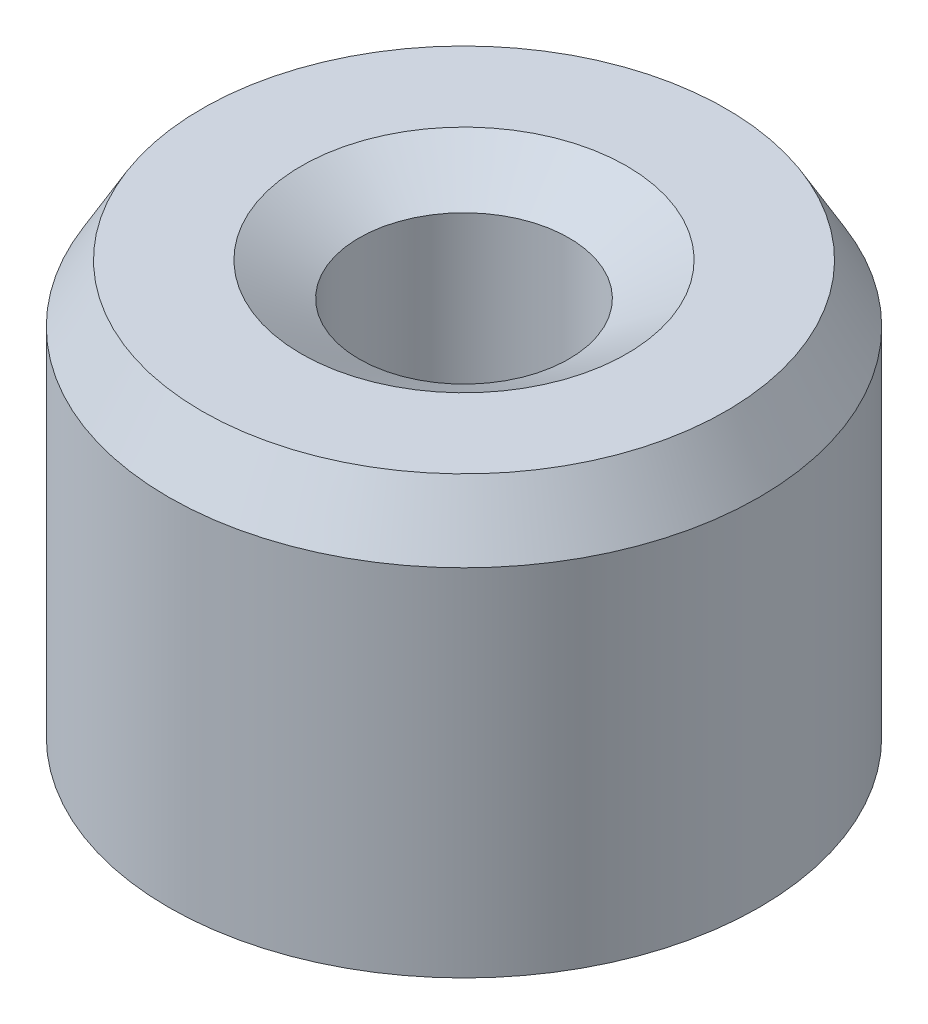
ISO-10303-21;
HEADER;
FILE_DESCRIPTION(('STEP AP214'),'2;1');
FILE_NAME('part.step','',(''),(''),'','','');
FILE_SCHEMA(('AUTOMOTIVE_DESIGN { 1 0 10303 214 1 1 1 1 }'));
ENDSEC;
DATA;
#1=APPLICATION_CONTEXT('core data for automotive mechanical design processes');
#2=APPLICATION_PROTOCOL_DEFINITION('international standard','automotive_design',2000,#1);
#3=PRODUCT_CONTEXT('',#1,'mechanical');
#4=PRODUCT('Part','Part','',(#3));
#5=PRODUCT_RELATED_PRODUCT_CATEGORY('part','',(#4));
#6=PRODUCT_DEFINITION_FORMATION('','',#4);
#7=PRODUCT_DEFINITION_CONTEXT('part definition',#1,'design');
#8=PRODUCT_DEFINITION('design','',#6,#7);
#9=PRODUCT_DEFINITION_SHAPE('','',#8);
#10=(LENGTH_UNIT() NAMED_UNIT(*) SI_UNIT(.MILLI.,.METRE.));
#11=(NAMED_UNIT(*) PLANE_ANGLE_UNIT() SI_UNIT($,.RADIAN.));
#12=(NAMED_UNIT(*) SI_UNIT($,.STERADIAN.) SOLID_ANGLE_UNIT());
#13=UNCERTAINTY_MEASURE_WITH_UNIT(LENGTH_MEASURE(1.E-05),#10,'distance_accuracy_value','');
#14=(GEOMETRIC_REPRESENTATION_CONTEXT(3) GLOBAL_UNCERTAINTY_ASSIGNED_CONTEXT((#13)) GLOBAL_UNIT_ASSIGNED_CONTEXT((#10,
#11,#12)) REPRESENTATION_CONTEXT('',''));
#15=CARTESIAN_POINT('',(0.,0.,0.));
#16=DIRECTION('',(0.,0.,1.));
#17=DIRECTION('',(1.,0.,0.));
#18=AXIS2_PLACEMENT_3D('',#15,#16,#17);
#19=CARTESIAN_POINT('',(0.,22.6669092342432,0.));
#20=DIRECTION('',(0.,-1.,0.));
#21=DIRECTION('',(0.,0.,-1.));
#22=AXIS2_PLACEMENT_3D('',#19,#20,#21);
#23=CYLINDRICAL_SURFACE('',#22,15.);
#24=CARTESIAN_POINT('',(0.,1.69389045083612,0.));
#25=DIRECTION('',(0.,1.,0.));
#26=DIRECTION('',(0.,0.,1.));
#27=AXIS2_PLACEMENT_3D('',#24,#25,#26);
#28=CIRCLE('',#27,15.);
#29=CARTESIAN_POINT('',(0.,1.69389045083612,15.));
#30=VERTEX_POINT('',#29);
#31=EDGE_CURVE('E10',#30,#30,#28,.T.);
#32=ORIENTED_EDGE('',*,*,#31,.T.);
#33=EDGE_LOOP('',(#32));
#34=FACE_BOUND('',#33,.T.);
#35=CARTESIAN_POINT('',(0.,19.7330049109393,0.));
#36=DIRECTION('',(0.,1.,0.));
#37=DIRECTION('',(0.,0.,1.));
#38=AXIS2_PLACEMENT_3D('',#35,#36,#37);
#39=CIRCLE('',#38,15.);
#40=CARTESIAN_POINT('',(0.,19.7330049109393,15.));
#41=VERTEX_POINT('',#40);
#42=EDGE_CURVE('E50',#41,#41,#39,.F.);
#43=ORIENTED_EDGE('',*,*,#42,.T.);
#44=EDGE_LOOP('',(#43));
#45=FACE_BOUND('',#44,.T.);
#46=ADVANCED_FACE('F39',(#34,#45),#23,.T.);
#47=CARTESIAN_POINT('',(0.,22.6669092342432,0.));
#48=DIRECTION('',(0.,1.,0.));
#49=DIRECTION('',(0.,0.,1.));
#50=AXIS2_PLACEMENT_3D('',#47,#48,#49);
#51=PLANE('',#50);
#52=CARTESIAN_POINT('',(0.,22.6669092342432,0.));
#53=DIRECTION('',(0.,1.,0.));
#54=DIRECTION('',(0.,0.,1.));
#55=AXIS2_PLACEMENT_3D('',#52,#53,#54);
#56=CIRCLE('',#55,8.26374945869014);
#57=CARTESIAN_POINT('',(0.,22.6669092342432,8.26374945869014));
#58=VERTEX_POINT('',#57);
#59=EDGE_CURVE('E58',#58,#58,#56,.F.);
#60=ORIENTED_EDGE('',*,*,#59,.T.);
#61=EDGE_LOOP('',(#60));
#62=FACE_BOUND('',#61,.T.);
#63=CARTESIAN_POINT('',(0.,22.6669092342432,0.));
#64=DIRECTION('',(0.,1.,0.));
#65=DIRECTION('',(0.,0.,1.));
#66=AXIS2_PLACEMENT_3D('',#63,#64,#65);
#67=CIRCLE('',#66,13.3061095491639);
#68=CARTESIAN_POINT('',(0.,22.6669092342432,13.3061095491639));
#69=VERTEX_POINT('',#68);
#70=EDGE_CURVE('E61',#69,#69,#67,.T.);
#71=ORIENTED_EDGE('',*,*,#70,.T.);
#72=EDGE_LOOP('',(#71));
#73=FACE_BOUND('',#72,.T.);
#74=ADVANCED_FACE('F88',(#62,#73),#51,.T.);
#75=CARTESIAN_POINT('',(0.,0.,0.));
#76=DIRECTION('',(0.,1.,0.));
#77=DIRECTION('',(0.,0.,1.));
#78=AXIS2_PLACEMENT_3D('',#75,#76,#77);
#79=PLANE('',#78);
#80=CARTESIAN_POINT('',(0.,0.,0.));
#81=DIRECTION('',(0.,1.,0.));
#82=DIRECTION('',(0.,0.,1.));
#83=AXIS2_PLACEMENT_3D('',#80,#81,#82);
#84=CIRCLE('',#83,7.02373558622232);
#85=CARTESIAN_POINT('',(0.,0.,7.02373558622232));
#86=VERTEX_POINT('',#85);
#87=EDGE_CURVE('E51',#86,#86,#84,.T.);
#88=ORIENTED_EDGE('',*,*,#87,.T.);
#89=EDGE_LOOP('',(#88));
#90=FACE_BOUND('',#89,.T.);
#91=CARTESIAN_POINT('',(0.,0.,0.));
#92=DIRECTION('',(0.,1.,0.));
#93=DIRECTION('',(0.,0.,1.));
#94=AXIS2_PLACEMENT_3D('',#91,#92,#93);
#95=CIRCLE('',#94,12.0660956766961);
#96=CARTESIAN_POINT('',(0.,0.,12.0660956766961));
#97=VERTEX_POINT('',#96);
#98=EDGE_CURVE('E54',#97,#97,#95,.F.);
#99=ORIENTED_EDGE('',*,*,#98,.T.);
#100=EDGE_LOOP('',(#99));
#101=FACE_BOUND('',#100,.T.);
#102=ADVANCED_FACE('F83',(#90,#101),#79,.F.);
#103=CARTESIAN_POINT('',(0.,22.6669092342432,0.));
#104=DIRECTION('',(0.,-1.,0.));
#105=DIRECTION('',(0.,0.,-1.));
#106=AXIS2_PLACEMENT_3D('',#103,#104,#105);
#107=CYLINDRICAL_SURFACE('',#106,5.32984513538621);
#108=CARTESIAN_POINT('',(0.,20.9730187834071,0.));
#109=DIRECTION('',(0.,1.,0.));
#110=DIRECTION('',(0.,0.,1.));
#111=AXIS2_PLACEMENT_3D('',#108,#109,#110);
#112=CIRCLE('',#111,5.32984513538621);
#113=CARTESIAN_POINT('',(0.,20.9730187834071,5.32984513538621));
#114=VERTEX_POINT('',#113);
#115=EDGE_CURVE('E67',#114,#114,#112,.T.);
#116=ORIENTED_EDGE('',*,*,#115,.T.);
#117=EDGE_LOOP('',(#116));
#118=FACE_BOUND('',#117,.T.);
#119=CARTESIAN_POINT('',(0.,2.93390432330393,0.));
#120=DIRECTION('',(0.,1.,0.));
#121=DIRECTION('',(0.,0.,1.));
#122=AXIS2_PLACEMENT_3D('',#119,#120,#121);
#123=CIRCLE('',#122,5.32984513538621);
#124=CARTESIAN_POINT('',(0.,2.93390432330393,5.32984513538621));
#125=VERTEX_POINT('',#124);
#126=EDGE_CURVE('E69',#125,#125,#123,.F.);
#127=ORIENTED_EDGE('',*,*,#126,.T.);
#128=EDGE_LOOP('',(#127));
#129=FACE_BOUND('',#128,.T.);
#130=ADVANCED_FACE('F71',(#118,#129),#107,.F.);
#131=CARTESIAN_POINT('',(0.,20.9730187834071,0.));
#132=DIRECTION('',(0.,1.,0.));
#133=DIRECTION('',(0.,0.,1.));
#134=AXIS2_PLACEMENT_3D('',#131,#132,#133);
#135=CONICAL_SURFACE('',#134,5.32984513538621,1.0471975511966);
#136=ORIENTED_EDGE('',*,*,#59,.F.);
#137=EDGE_LOOP('',(#136));
#138=FACE_BOUND('',#137,.T.);
#139=ORIENTED_EDGE('',*,*,#115,.F.);
#140=EDGE_LOOP('',(#139));
#141=FACE_BOUND('',#140,.T.);
#142=ADVANCED_FACE('F77',(#138,#141),#135,.F.);
#143=CARTESIAN_POINT('',(0.,0.,0.));
#144=DIRECTION('',(0.,-1.,0.));
#145=DIRECTION('',(0.,0.,-1.));
#146=AXIS2_PLACEMENT_3D('',#143,#144,#145);
#147=CONICAL_SURFACE('',#146,7.02373558622232,0.523598775598294);
#148=ORIENTED_EDGE('',*,*,#126,.F.);
#149=EDGE_LOOP('',(#148));
#150=FACE_BOUND('',#149,.T.);
#151=ORIENTED_EDGE('',*,*,#87,.F.);
#152=EDGE_LOOP('',(#151));
#153=FACE_BOUND('',#152,.T.);
#154=ADVANCED_FACE('F73',(#150,#153),#147,.F.);
#155=CARTESIAN_POINT('',(0.,1.69389045083612,0.));
#156=DIRECTION('',(0.,1.,0.));
#157=DIRECTION('',(0.,0.,1.));
#158=AXIS2_PLACEMENT_3D('',#155,#156,#157);
#159=CONICAL_SURFACE('',#158,15.,1.0471975511966);
#160=ORIENTED_EDGE('',*,*,#98,.F.);
#161=EDGE_LOOP('',(#160));
#162=FACE_BOUND('',#161,.T.);
#163=ORIENTED_EDGE('',*,*,#31,.F.);
#164=EDGE_LOOP('',(#163));
#165=FACE_BOUND('',#164,.T.);
#166=ADVANCED_FACE('F76',(#162,#165),#159,.T.);
#167=CARTESIAN_POINT('',(0.,22.6669092342432,0.));
#168=DIRECTION('',(0.,-1.,0.));
#169=DIRECTION('',(0.,0.,-1.));
#170=AXIS2_PLACEMENT_3D('',#167,#168,#169);
#171=CONICAL_SURFACE('',#170,13.3061095491639,0.523598775598296);
#172=ORIENTED_EDGE('',*,*,#42,.F.);
#173=EDGE_LOOP('',(#172));
#174=FACE_BOUND('',#173,.T.);
#175=ORIENTED_EDGE('',*,*,#70,.F.);
#176=EDGE_LOOP('',(#175));
#177=FACE_BOUND('',#176,.T.);
#178=ADVANCED_FACE('F45',(#174,#177),#171,.T.);
#179=CLOSED_SHELL('',(#46,#74,#102,#130,#142,#154,#166,#178));
#180=MANIFOLD_SOLID_BREP('B2',#179);
#181=ADVANCED_BREP_SHAPE_REPRESENTATION('',(#18,#180),#14);
#182=SHAPE_DEFINITION_REPRESENTATION(#9,#181);
ENDSEC;
END-ISO-10303-21;
